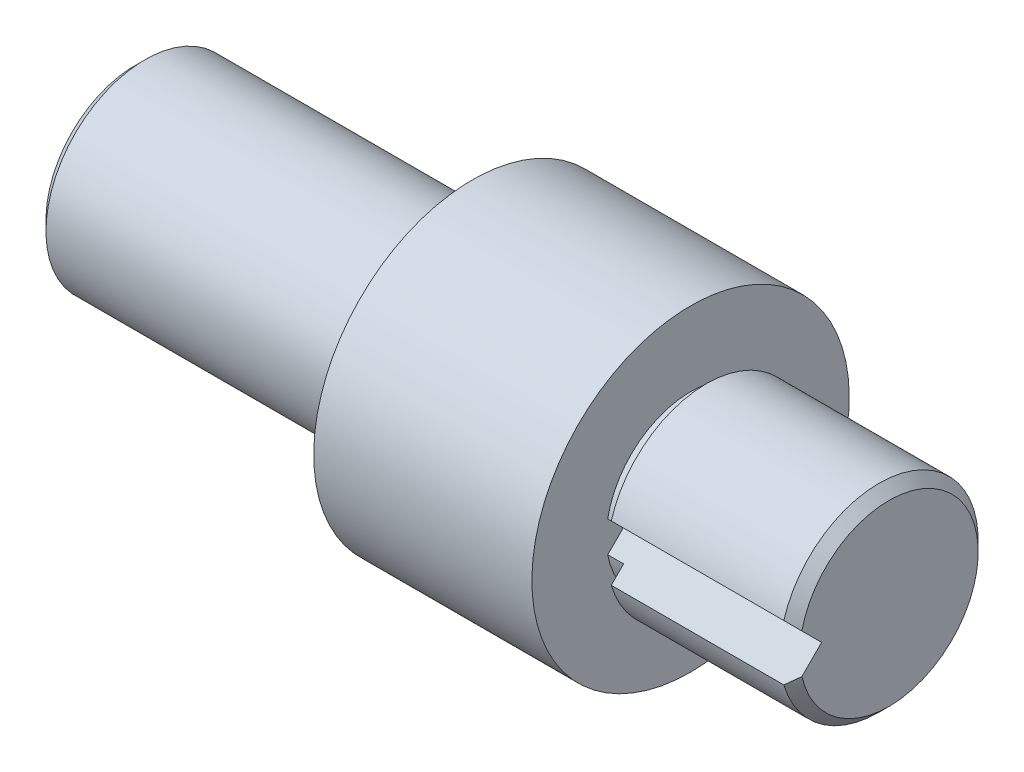
ISO-10303-21;
HEADER;
FILE_DESCRIPTION(('STEP AP214'),'2;1');
FILE_NAME('part.step','',(''),(''),'','','');
FILE_SCHEMA(('AUTOMOTIVE_DESIGN { 1 0 10303 214 1 1 1 1 }'));
ENDSEC;
DATA;
#1=APPLICATION_CONTEXT('core data for automotive mechanical design processes');
#2=APPLICATION_PROTOCOL_DEFINITION('international standard','automotive_design',2000,#1);
#3=PRODUCT_CONTEXT('',#1,'mechanical');
#4=PRODUCT('Part','Part','',(#3));
#5=PRODUCT_RELATED_PRODUCT_CATEGORY('part','',(#4));
#6=PRODUCT_DEFINITION_FORMATION('','',#4);
#7=PRODUCT_DEFINITION_CONTEXT('part definition',#1,'design');
#8=PRODUCT_DEFINITION('design','',#6,#7);
#9=PRODUCT_DEFINITION_SHAPE('','',#8);
#10=(LENGTH_UNIT() NAMED_UNIT(*) SI_UNIT(.MILLI.,.METRE.));
#11=(NAMED_UNIT(*) PLANE_ANGLE_UNIT() SI_UNIT($,.RADIAN.));
#12=(NAMED_UNIT(*) SI_UNIT($,.STERADIAN.) SOLID_ANGLE_UNIT());
#13=UNCERTAINTY_MEASURE_WITH_UNIT(LENGTH_MEASURE(1.E-05),#10,'distance_accuracy_value','');
#14=(GEOMETRIC_REPRESENTATION_CONTEXT(3) GLOBAL_UNCERTAINTY_ASSIGNED_CONTEXT((#13)) GLOBAL_UNIT_ASSIGNED_CONTEXT((#10,
#11,#12)) REPRESENTATION_CONTEXT('',''));
#15=CARTESIAN_POINT('',(0.,0.,0.));
#16=DIRECTION('',(0.,0.,1.));
#17=DIRECTION('',(1.,0.,0.));
#18=AXIS2_PLACEMENT_3D('',#15,#16,#17);
#19=CARTESIAN_POINT('',(98.,0.,0.));
#20=DIRECTION('',(-1.,0.,0.));
#21=DIRECTION('',(0.,1.,0.));
#22=AXIS2_PLACEMENT_3D('',#19,#20,#21);
#23=CYLINDRICAL_SURFACE('',#22,42.5);
#24=DIRECTION('',(-1.,0.,0.));
#25=VECTOR('',#24,1.);
#26=CARTESIAN_POINT('',(98.,-7.83265463432986,41.77199446255));
#27=LINE('',#26,#25);
#28=CARTESIAN_POINT('',(90.,-7.83265463432986,41.77199446255));
#29=VERTEX_POINT('',#28);
#30=CARTESIAN_POINT('',(98.,-7.83265463432986,41.77199446255));
#31=VERTEX_POINT('',#30);
#32=EDGE_CURVE('E10',#29,#31,#27,.F.);
#33=ORIENTED_EDGE('',*,*,#32,.F.);
#34=CARTESIAN_POINT('',(90.,0.,0.));
#35=DIRECTION('',(1.,0.,0.));
#36=DIRECTION('',(0.,-1.,0.));
#37=AXIS2_PLACEMENT_3D('',#34,#35,#36);
#38=CIRCLE('',#37,42.5);
#39=CARTESIAN_POINT('',(90.,7.83265463432986,41.77199446255));
#40=VERTEX_POINT('',#39);
#41=EDGE_CURVE('E24',#29,#40,#38,.T.);
#42=ORIENTED_EDGE('',*,*,#41,.T.);
#43=DIRECTION('',(-1.,0.,0.));
#44=VECTOR('',#43,1.);
#45=CARTESIAN_POINT('',(98.,7.83265463432987,41.77199446255));
#46=LINE('',#45,#44);
#47=CARTESIAN_POINT('',(98.,7.83265463432987,41.77199446255));
#48=VERTEX_POINT('',#47);
#49=EDGE_CURVE('E270',#40,#48,#46,.F.);
#50=ORIENTED_EDGE('',*,*,#49,.T.);
#51=CARTESIAN_POINT('',(98.,0.,0.));
#52=DIRECTION('',(1.,0.,0.));
#53=DIRECTION('',(0.,-1.,0.));
#54=AXIS2_PLACEMENT_3D('',#51,#52,#53);
#55=CIRCLE('',#54,42.5);
#56=EDGE_CURVE('E253',#31,#48,#55,.T.);
#57=ORIENTED_EDGE('',*,*,#56,.F.);
#58=EDGE_LOOP('',(#33,#42,#50,#57));
#59=FACE_BOUND('',#58,.T.);
#60=ADVANCED_FACE('F16',(#59),#23,.T.);
#61=CARTESIAN_POINT('',(98.,0.,0.));
#62=DIRECTION('',(1.,0.,0.));
#63=DIRECTION('',(0.,0.,-1.));
#64=AXIS2_PLACEMENT_3D('',#61,#62,#63);
#65=PLANE('',#64);
#66=DIRECTION('',(0.,-0.707106781186547,0.707106781186548));
#67=VECTOR('',#66,1.);
#68=CARTESIAN_POINT('',(98.,16.9696699141101,16.9696699141101));
#69=LINE('',#68,#67);
#70=CARTESIAN_POINT('',(98.,-14.0469434246499,47.9862832528701));
#71=VERTEX_POINT('',#70);
#72=EDGE_CURVE('E252',#31,#71,#69,.T.);
#73=ORIENTED_EDGE('',*,*,#72,.F.);
#74=ORIENTED_EDGE('',*,*,#56,.T.);
#75=DIRECTION('',(0.,0.707106781186547,0.707106781186548));
#76=VECTOR('',#75,1.);
#77=CARTESIAN_POINT('',(98.,-16.9696699141101,16.9696699141101));
#78=LINE('',#77,#76);
#79=CARTESIAN_POINT('',(98.,14.0469434246499,47.9862832528701));
#80=VERTEX_POINT('',#79);
#81=EDGE_CURVE('E260',#48,#80,#78,.T.);
#82=ORIENTED_EDGE('',*,*,#81,.T.);
#83=CARTESIAN_POINT('',(98.,0.,0.));
#84=DIRECTION('',(1.,0.,0.));
#85=DIRECTION('',(0.,-1.,0.));
#86=AXIS2_PLACEMENT_3D('',#83,#84,#85);
#87=CIRCLE('',#86,50.);
#88=EDGE_CURVE('E256',#71,#80,#87,.T.);
#89=ORIENTED_EDGE('',*,*,#88,.F.);
#90=EDGE_LOOP('',(#73,#74,#82,#89));
#91=FACE_BOUND('',#90,.T.);
#92=ADVANCED_FACE('F239',(#91),#65,.F.);
#93=CARTESIAN_POINT('',(0.,0.,0.));
#94=DIRECTION('',(1.,0.,0.));
#95=DIRECTION('',(0.,-1.,0.));
#96=AXIS2_PLACEMENT_3D('',#93,#94,#95);
#97=CYLINDRICAL_SURFACE('',#96,50.);
#98=DIRECTION('',(1.,0.,0.));
#99=VECTOR('',#98,1.);
#100=CARTESIAN_POINT('',(0.,-14.0469434246499,47.9862832528701));
#101=LINE('',#100,#99);
#102=CARTESIAN_POINT('',(185.,-14.0469434246499,47.9862832528701));
#103=VERTEX_POINT('',#102);
#104=EDGE_CURVE('E280',#71,#103,#101,.T.);
#105=ORIENTED_EDGE('',*,*,#104,.F.);
#106=ORIENTED_EDGE('',*,*,#88,.T.);
#107=DIRECTION('',(1.,0.,0.));
#108=VECTOR('',#107,1.);
#109=CARTESIAN_POINT('',(0.,14.0469434246499,47.9862832528701));
#110=LINE('',#109,#108);
#111=CARTESIAN_POINT('',(185.,14.0469434246499,47.9862832528701));
#112=VERTEX_POINT('',#111);
#113=EDGE_CURVE('E283',#80,#112,#110,.T.);
#114=ORIENTED_EDGE('',*,*,#113,.T.);
#115=CARTESIAN_POINT('',(185.,0.,0.));
#116=DIRECTION('',(-1.,0.,0.));
#117=DIRECTION('',(0.,1.,0.));
#118=AXIS2_PLACEMENT_3D('',#115,#116,#117);
#119=CIRCLE('',#118,50.);
#120=EDGE_CURVE('E286',#112,#103,#119,.T.);
#121=ORIENTED_EDGE('',*,*,#120,.T.);
#122=EDGE_LOOP('',(#105,#106,#114,#121));
#123=FACE_BOUND('',#122,.T.);
#124=ADVANCED_FACE('F243',(#123),#97,.T.);
#125=CARTESIAN_POINT('',(190.,0.,0.));
#126=DIRECTION('',(-1.,0.,0.));
#127=DIRECTION('',(0.,1.,0.));
#128=AXIS2_PLACEMENT_3D('',#125,#126,#127);
#129=CONICAL_SURFACE('',#128,45.,0.785398163397448);
#130=CARTESIAN_POINT('',(190.,0.,0.));
#131=DIRECTION('',(-1.,0.,0.));
#132=DIRECTION('',(0.,1.,0.));
#133=AXIS2_PLACEMENT_3D('',#130,#131,#132);
#134=CIRCLE('',#133,45.);
#135=CARTESIAN_POINT('',(190.,-9.94743065423022,43.8867704824504));
#136=VERTEX_POINT('',#135);
#137=CARTESIAN_POINT('',(190.,9.94743065423022,43.8867704824504));
#138=VERTEX_POINT('',#137);
#139=EDGE_CURVE('E288',#136,#138,#134,.F.);
#140=ORIENTED_EDGE('',*,*,#139,.F.);
#141=CARTESIAN_POINT('',(211.001262638053,16.9703699141101,16.9689699141101));
#142=CARTESIAN_POINT('',(211.00132100937,16.7092190554222,17.230120772798));
#143=CARTESIAN_POINT('',(210.992768828976,16.4480784222024,17.4912614060177));
#144=CARTESIAN_POINT('',(210.958763727207,15.9263895368803,18.0129502913399));
#145=CARTESIAN_POINT('',(210.933313591487,15.6658411942405,18.2734986339797));
#146=CARTESIAN_POINT('',(210.865901353758,15.1463510554629,18.7929887727572));
#147=CARTESIAN_POINT('',(210.823972929956,14.8874070699475,19.0519327582726));
#148=CARTESIAN_POINT('',(210.724209691066,14.3710657776574,19.5682740505628));
#149=CARTESIAN_POINT('',(210.666374333934,14.1136685238943,19.8256713043258));
#150=CARTESIAN_POINT('',(210.472574929819,13.3541240536849,20.5852157745352));
#151=CARTESIAN_POINT('',(210.31496696045,12.8546773790613,21.0846624491588));
#152=CARTESIAN_POINT('',(209.948209221688,11.8652788373485,22.0740609908716));
#153=CARTESIAN_POINT('',(209.739034517823,11.3753316876302,22.5640081405899));
#154=CARTESIAN_POINT('',(209.255088147791,10.3606147767767,23.5787250514435));
#155=CARTESIAN_POINT('',(208.976008588694,9.83687929340208,24.1024605348181));
#156=CARTESIAN_POINT('',(208.374480321438,8.80191410108605,25.1374257271341));
#157=CARTESIAN_POINT('',(208.052014319589,8.29068947546181,25.6486503527584));
#158=CARTESIAN_POINT('',(207.371304771633,7.27942984629425,26.6599099819259));
#159=CARTESIAN_POINT('',(207.013007770877,6.77941296540337,27.1599268628168));
#160=CARTESIAN_POINT('',(206.267713940816,5.79033452198054,28.1490053062396));
#161=CARTESIAN_POINT('',(205.880720478176,5.30127168305995,28.6380681451602));
#162=CARTESIAN_POINT('',(205.074478435229,4.32211545610026,29.6172243721199));
#163=CARTESIAN_POINT('',(204.654705442711,3.83223895333086,30.1071008748893));
#164=CARTESIAN_POINT('',(203.795162733964,2.8613566978441,31.0779831303761));
#165=CARTESIAN_POINT('',(203.355392524081,2.38035116452858,31.5589886636916));
#166=CARTESIAN_POINT('',(202.459782535087,1.42649642523632,32.5128434029839));
#167=CARTESIAN_POINT('',(202.003956849569,0.953640583004033,32.9856992452161));
#168=CARTESIAN_POINT('',(201.078669668715,0.0146718291301209,33.9246679990901));
#169=CARTESIAN_POINT('',(200.609208301858,-0.451441145982424,34.3907809742026));
#170=CARTESIAN_POINT('',(199.534381249478,-1.49915199387172,35.4384918220919));
#171=CARTESIAN_POINT('',(198.925632854948,-2.07901278589279,36.018352614113));
#172=CARTESIAN_POINT('',(197.693441344598,-3.23086836786665,37.1702081960868));
#173=CARTESIAN_POINT('',(197.069997941765,-3.80286300383748,37.7422028320577));
#174=CARTESIAN_POINT('',(195.810847478271,-4.94038394032648,38.8797237685467));
#175=CARTESIAN_POINT('',(195.175136082862,-5.50590783774737,39.4452476659676));
#176=CARTESIAN_POINT('',(193.893740376253,-6.63126034864432,40.5706001768645));
#177=CARTESIAN_POINT('',(193.248056159404,-7.1910890159187,41.1304288441389));
#178=CARTESIAN_POINT('',(191.977243266815,-8.28107124590155,42.2204110741217));
#179=CARTESIAN_POINT('',(191.352478079559,-8.81143697171714,42.7507767999373));
#180=CARTESIAN_POINT('',(190.096444157929,-9.86830622587897,43.8076460540992));
#181=CARTESIAN_POINT('',(189.465175384811,-10.3948097311853,44.3341495594055));
#182=CARTESIAN_POINT('',(188.197554705766,-11.4440443793413,45.3833842075615));
#183=CARTESIAN_POINT('',(187.561207085448,-11.966778113434,45.9061179416542));
#184=CARTESIAN_POINT('',(186.283691184519,-13.0092705949445,46.9486104231647));
#185=CARTESIAN_POINT('',(185.64252302157,-13.5290294144322,47.4683692426524));
#186=CARTESIAN_POINT('',(184.9993,-14.0475076372266,47.9868474654468));
#187=B_SPLINE_CURVE_WITH_KNOTS('',3,(#141,#142,#143,#144,#145,#146,#147,#148,#149,#150,#151,
#152,#153,#154,#155,#156,#157,#158,#159,#160,#161,#162,#163,#164,#165,#166,#167,#168,#169,#170,
#171,#172,#173,#174,#175,#176,#177,#178,#179,#180,#181,#182,#183,#184,#185,#186),.UNSPECIFIED.,
.F.,.F.,(4,2,2,2,2,2,2,2,2,2,2,2,2,2,2,2,2,2,2,2,2,2,4),(0.,1.10784532325466,2.21550806181202,
3.32091864251884,4.42636689574189,6.59500590885997,8.76469560506129,11.1375165568639,
13.5112861247816,15.8886513944538,18.2657381918927,20.6954505791791,23.1252229791155,
25.5529132108967,27.9805805758278,31.0442640740374,34.1080074594968,37.1728539555617,
40.2376714735127,43.1661383392042,46.0946226603617,49.0208533459384,51.9470128382813),.UNSPECIFIED.);
#188=EDGE_CURVE('E215',#136,#103,#187,.T.);
#189=ORIENTED_EDGE('',*,*,#188,.T.);
#190=ORIENTED_EDGE('',*,*,#120,.F.);
#191=CARTESIAN_POINT('',(211.001262638053,-16.9703699141101,16.9689699141101));
#192=CARTESIAN_POINT('',(211.00132100937,-16.7092190554222,17.230120772798));
#193=CARTESIAN_POINT('',(210.992768828976,-16.4480784222024,17.4912614060177));
#194=CARTESIAN_POINT('',(210.958763727207,-15.9263895368803,18.0129502913399));
#195=CARTESIAN_POINT('',(210.933313591487,-15.6658411942405,18.2734986339797));
#196=CARTESIAN_POINT('',(210.865901353758,-15.1463510554629,18.7929887727572));
#197=CARTESIAN_POINT('',(210.823972929956,-14.8874070699475,19.0519327582726));
#198=CARTESIAN_POINT('',(210.724209691066,-14.3710657776574,19.5682740505628));
#199=CARTESIAN_POINT('',(210.666374333934,-14.1136685238943,19.8256713043258));
#200=CARTESIAN_POINT('',(210.472574929819,-13.3541240536849,20.5852157745352));
#201=CARTESIAN_POINT('',(210.31496696045,-12.8546773790613,21.0846624491588));
#202=CARTESIAN_POINT('',(209.948209221688,-11.8652788373485,22.0740609908716));
#203=CARTESIAN_POINT('',(209.739034517823,-11.3753316876302,22.5640081405899));
#204=CARTESIAN_POINT('',(209.255088147791,-10.3606147767767,23.5787250514435));
#205=CARTESIAN_POINT('',(208.976008588694,-9.83687929340208,24.1024605348181));
#206=CARTESIAN_POINT('',(208.374480321438,-8.80191410108605,25.1374257271341));
#207=CARTESIAN_POINT('',(208.052014319589,-8.29068947546181,25.6486503527584));
#208=CARTESIAN_POINT('',(207.371304771633,-7.27942984629425,26.6599099819259));
#209=CARTESIAN_POINT('',(207.013007770877,-6.77941296540337,27.1599268628168));
#210=CARTESIAN_POINT('',(206.267713940816,-5.79033452198054,28.1490053062396));
#211=CARTESIAN_POINT('',(205.880720478176,-5.30127168305995,28.6380681451602));
#212=CARTESIAN_POINT('',(205.074478435229,-4.32211545610026,29.6172243721199));
#213=CARTESIAN_POINT('',(204.654705442711,-3.83223895333086,30.1071008748893));
#214=CARTESIAN_POINT('',(203.795162733964,-2.8613566978441,31.0779831303761));
#215=CARTESIAN_POINT('',(203.355392524081,-2.38035116452858,31.5589886636916));
#216=CARTESIAN_POINT('',(202.459782535087,-1.42649642523632,32.5128434029839));
#217=CARTESIAN_POINT('',(202.003956849569,-0.953640583004033,32.9856992452161));
#218=CARTESIAN_POINT('',(201.078669668715,-0.0146718291301209,33.9246679990901));
#219=CARTESIAN_POINT('',(200.609208301858,0.451441145982424,34.3907809742026));
#220=CARTESIAN_POINT('',(199.534381249478,1.49915199387172,35.4384918220919));
#221=CARTESIAN_POINT('',(198.925632854948,2.07901278589279,36.018352614113));
#222=CARTESIAN_POINT('',(197.693441344598,3.23086836786665,37.1702081960868));
#223=CARTESIAN_POINT('',(197.069997941765,3.80286300383748,37.7422028320577));
#224=CARTESIAN_POINT('',(195.810847478271,4.94038394032648,38.8797237685467));
#225=CARTESIAN_POINT('',(195.175136082862,5.50590783774737,39.4452476659676));
#226=CARTESIAN_POINT('',(193.893740376253,6.63126034864432,40.5706001768645));
#227=CARTESIAN_POINT('',(193.248056159404,7.1910890159187,41.1304288441389));
#228=CARTESIAN_POINT('',(191.977243266815,8.28107124590155,42.2204110741217));
#229=CARTESIAN_POINT('',(191.352478079559,8.81143697171714,42.7507767999373));
#230=CARTESIAN_POINT('',(190.096444157929,9.86830622587897,43.8076460540992));
#231=CARTESIAN_POINT('',(189.465175384811,10.3948097311853,44.3341495594055));
#232=CARTESIAN_POINT('',(188.197554705766,11.4440443793413,45.3833842075615));
#233=CARTESIAN_POINT('',(187.561207085448,11.966778113434,45.9061179416542));
#234=CARTESIAN_POINT('',(186.283691184519,13.0092705949445,46.9486104231647));
#235=CARTESIAN_POINT('',(185.64252302157,13.5290294144322,47.4683692426524));
#236=CARTESIAN_POINT('',(184.9993,14.0475076372266,47.9868474654468));
#237=B_SPLINE_CURVE_WITH_KNOTS('',3,(#191,#192,#193,#194,#195,#196,#197,#198,#199,#200,#201,
#202,#203,#204,#205,#206,#207,#208,#209,#210,#211,#212,#213,#214,#215,#216,#217,#218,#219,#220,
#221,#222,#223,#224,#225,#226,#227,#228,#229,#230,#231,#232,#233,#234,#235,#236),.UNSPECIFIED.,
.F.,.F.,(4,2,2,2,2,2,2,2,2,2,2,2,2,2,2,2,2,2,2,2,2,2,4),(0.,1.10784532325466,2.21550806181202,
3.32091864251884,4.42636689574189,6.59500590885997,8.76469560506129,11.1375165568639,
13.5112861247816,15.8886513944538,18.2657381918927,20.6954505791791,23.1252229791155,
25.5529132108967,27.9805805758278,31.0442640740374,34.1080074594968,37.1728539555617,
40.2376714735127,43.1661383392042,46.0946226603617,49.0208533459384,51.9470128382813),.UNSPECIFIED.);
#238=EDGE_CURVE('E206',#138,#112,#237,.T.);
#239=ORIENTED_EDGE('',*,*,#238,.F.);
#240=EDGE_LOOP('',(#140,#189,#190,#239));
#241=FACE_BOUND('',#240,.T.);
#242=ADVANCED_FACE('F222',(#241),#129,.T.);
#243=CARTESIAN_POINT('',(0.,0.,0.));
#244=DIRECTION('',(1.,0.,0.));
#245=DIRECTION('',(0.,-1.,0.));
#246=AXIS2_PLACEMENT_3D('',#243,#244,#245);
#247=CYLINDRICAL_SURFACE('',#246,50.);
#248=CARTESIAN_POINT('',(-20.,0.,0.));
#249=DIRECTION('',(1.,0.,0.));
#250=DIRECTION('',(0.,-1.,0.));
#251=AXIS2_PLACEMENT_3D('',#248,#249,#250);
#252=CIRCLE('',#251,50.);
#253=CARTESIAN_POINT('',(-20.,-50.,0.));
#254=VERTEX_POINT('',#253);
#255=EDGE_CURVE('E202',#254,#254,#252,.T.);
#256=ORIENTED_EDGE('',*,*,#255,.F.);
#257=EDGE_LOOP('',(#256));
#258=FACE_BOUND('',#257,.T.);
#259=CARTESIAN_POINT('',(-185.,0.,0.));
#260=DIRECTION('',(1.,0.,0.));
#261=DIRECTION('',(0.,-1.,0.));
#262=AXIS2_PLACEMENT_3D('',#259,#260,#261);
#263=CIRCLE('',#262,50.);
#264=CARTESIAN_POINT('',(-185.,-50.,0.));
#265=VERTEX_POINT('',#264);
#266=EDGE_CURVE('E198',#265,#265,#263,.T.);
#267=ORIENTED_EDGE('',*,*,#266,.T.);
#268=EDGE_LOOP('',(#267));
#269=FACE_BOUND('',#268,.T.);
#270=DIRECTION('',(1.,0.,0.));
#271=VECTOR('',#270,1.);
#272=CARTESIAN_POINT('',(0.,-48.9897948556635,-10.));
#273=LINE('',#272,#271);
#274=CARTESIAN_POINT('',(-145.,-48.9897948556635,-10.));
#275=VERTEX_POINT('',#274);
#276=CARTESIAN_POINT('',(-60.,-48.9897948556635,-10.));
#277=VERTEX_POINT('',#276);
#278=EDGE_CURVE('E194',#275,#277,#273,.T.);
#279=ORIENTED_EDGE('',*,*,#278,.F.);
#280=CARTESIAN_POINT('',(-145.,-48.9897948556635,10.));
#281=CARTESIAN_POINT('',(-145.278250654908,-48.9897699291574,10.0000333357109));
#282=CARTESIAN_POINT('',(-145.556492680861,-48.992164609233,9.98838794442636));
#283=CARTESIAN_POINT('',(-146.110929686242,-49.0016122208878,9.94198341928341));
#284=CARTESIAN_POINT('',(-146.387124914627,-49.008664576215,9.90722714472148));
#285=CARTESIAN_POINT('',(-146.935091622416,-49.0272325385723,9.81491465856866));
#286=CARTESIAN_POINT('',(-147.206869187374,-49.0387413456958,9.75739318047743));
#287=CARTESIAN_POINT('',(-147.744506804701,-49.0658769158927,9.62001314196522));
#288=CARTESIAN_POINT('',(-148.010366832909,-49.0815036957769,9.54015449035789));
#289=CARTESIAN_POINT('',(-148.534335659072,-49.1164246464479,9.35870445119324));
#290=CARTESIAN_POINT('',(-148.792443860916,-49.1357190984454,9.2571113971232));
#291=CARTESIAN_POINT('',(-149.299130583575,-49.1774213101814,9.03295210767035));
#292=CARTESIAN_POINT('',(-149.547708825725,-49.1998291608703,8.91038525956354));
#293=CARTESIAN_POINT('',(-150.033676036636,-49.2471257736464,8.64515700263522));
#294=CARTESIAN_POINT('',(-150.271064216013,-49.272014710373,8.50249417899873));
#295=CARTESIAN_POINT('',(-150.733062437915,-49.3235775005206,8.19808055914538));
#296=CARTESIAN_POINT('',(-150.957672398505,-49.3502513653845,8.03632964055267));
#297=CARTESIAN_POINT('',(-151.395329060699,-49.4049846361266,7.69273157073024));
#298=CARTESIAN_POINT('',(-151.608198631959,-49.4330570878751,7.51066083956167));
#299=CARTESIAN_POINT('',(-152.017988917821,-49.4895034689847,7.12925080203784));
#300=CARTESIAN_POINT('',(-152.214902693137,-49.517877523511,6.92990405939758));
#301=CARTESIAN_POINT('',(-152.591377615559,-49.5741299068461,6.51532049891614));
#302=CARTESIAN_POINT('',(-152.770935866606,-49.6020081522899,6.3000810396431));
#303=CARTESIAN_POINT('',(-153.111349281425,-49.6564775379925,5.8552889050474));
#304=CARTESIAN_POINT('',(-153.272212790405,-49.6830692494334,5.62574268701584));
#305=CARTESIAN_POINT('',(-153.575550562996,-49.7344700887598,5.151681691423));
#306=CARTESIAN_POINT('',(-153.717847305987,-49.7592611270118,4.9070513062857));
#307=CARTESIAN_POINT('',(-153.981294447689,-49.8060923791999,4.40640031936312));
#308=CARTESIAN_POINT('',(-154.102444683389,-49.8281325719302,4.15037962979299));
#309=CARTESIAN_POINT('',(-154.322662476411,-49.8688311429154,3.62878653067056));
#310=CARTESIAN_POINT('',(-154.421732832951,-49.8874899497955,3.3632153368644));
#311=CARTESIAN_POINT('',(-154.597032379126,-49.9208936168796,2.82439888898941));
#312=CARTESIAN_POINT('',(-154.673261904089,-49.9356385345431,2.55115374764647));
#313=CARTESIAN_POINT('',(-154.801417905872,-49.9606234229039,2.00262053187489));
#314=CARTESIAN_POINT('',(-154.853650998758,-49.9709201232142,1.7274066603485));
#315=CARTESIAN_POINT('',(-154.93485836934,-49.9869965368054,1.17343752518298));
#316=CARTESIAN_POINT('',(-154.96383282987,-49.9927762855935,0.894682289399612));
#317=CARTESIAN_POINT('',(-154.998286325014,-49.999654433721,0.335683041091922));
#318=CARTESIAN_POINT('',(-155.003766798568,-50.000753119762,0.055439120797931));
#319=CARTESIAN_POINT('',(-154.991191226663,-49.9982386073088,-0.5044976573417));
#320=CARTESIAN_POINT('',(-154.973135364519,-49.9946254455132,-0.784190519462302));
#321=CARTESIAN_POINT('',(-154.914060656264,-49.9828748494924,-1.33700025686813));
#322=CARTESIAN_POINT('',(-154.8733732099,-49.9748027205131,-1.61015401434812));
#323=CARTESIAN_POINT('',(-154.769593778504,-49.954402980861,-2.1520059892224));
#324=CARTESIAN_POINT('',(-154.706502042133,-49.9420754174183,-2.42070425603266));
#325=CARTESIAN_POINT('',(-154.558399137863,-49.9135023812472,-2.95177957601672));
#326=CARTESIAN_POINT('',(-154.473387557183,-49.8972568347381,-3.21415651004949));
#327=CARTESIAN_POINT('',(-154.282084863838,-49.8612903967446,-3.73078800120407));
#328=CARTESIAN_POINT('',(-154.175793546167,-49.8415694717792,-3.98504248004815));
#329=CARTESIAN_POINT('',(-153.941993319284,-49.7990557796206,-4.48524688665998));
#330=CARTESIAN_POINT('',(-153.814358207565,-49.7762449042184,-4.73113627727346));
#331=CARTESIAN_POINT('',(-153.539203162023,-49.7282579698431,-5.21139397424728));
#332=CARTESIAN_POINT('',(-153.391676333132,-49.7030810916636,-5.44575824704121));
#333=CARTESIAN_POINT('',(-153.077818086602,-49.6510544366632,-5.90130100015426));
#334=CARTESIAN_POINT('',(-152.911488704877,-49.6242048411031,-6.12248090410571));
#335=CARTESIAN_POINT('',(-152.561142200263,-49.5695565914247,-6.55023359884725));
#336=CARTESIAN_POINT('',(-152.377124859019,-49.5417579255931,-6.75680620925868));
#337=CARTESIAN_POINT('',(-151.989261356017,-49.4854759153548,-7.15746597535053));
#338=CARTESIAN_POINT('',(-151.78512457887,-49.4569891016899,-7.35127142227593));
#339=CARTESIAN_POINT('',(-151.361265157231,-49.4006234685481,-7.72096918466996));
#340=CARTESIAN_POINT('',(-151.141547425914,-49.372744461004,-7.89686710471781));
#341=CARTESIAN_POINT('',(-150.687852093376,-49.3183630056501,-8.22967334971856));
#342=CARTESIAN_POINT('',(-150.453867975389,-49.2918611973277,-8.38657289717345));
#343=CARTESIAN_POINT('',(-149.973332893309,-49.2410090438121,-8.68016323027539));
#344=CARTESIAN_POINT('',(-149.726782333702,-49.2166586294389,-8.81685466582674));
#345=CARTESIAN_POINT('',(-149.222112019175,-49.1707527082268,-9.06937720273905));
#346=CARTESIAN_POINT('',(-148.963962297199,-49.1492050762103,-9.18514986994259));
#347=CARTESIAN_POINT('',(-148.438553967586,-49.1096227565596,-9.39448287535094));
#348=CARTESIAN_POINT('',(-148.171295685322,-49.0915879435956,-9.48804400604077));
#349=CARTESIAN_POINT('',(-147.629919482344,-49.0595918623669,-9.65212064022865));
#350=CARTESIAN_POINT('',(-147.355810361629,-49.0456256332785,-9.72266422173277));
#351=CARTESIAN_POINT('',(-146.802524948368,-49.0221659831858,-9.84026622036216));
#352=CARTESIAN_POINT('',(-146.523351131185,-49.0126704352163,-9.88733580607651));
#353=CARTESIAN_POINT('',(-146.036481595186,-49.0003245998265,-9.94831108366072));
#354=CARTESIAN_POINT('',(-145.82948346313,-48.9963794230734,-9.96770341545518));
#355=CARTESIAN_POINT('',(-145.41499653944,-48.9911133039178,-9.99354077240532));
#356=CARTESIAN_POINT('',(-145.207509153673,-48.9897879698236,-10.0000074652566));
#357=CARTESIAN_POINT('',(-145.,-48.9897948556635,-10.));
#358=B_SPLINE_CURVE_WITH_KNOTS('',3,(#280,#281,#282,#283,#284,#285,#286,#287,#288,#289,#290,
#291,#292,#293,#294,#295,#296,#297,#298,#299,#300,#301,#302,#303,#304,#305,#306,#307,#308,#309,
#310,#311,#312,#313,#314,#315,#316,#317,#318,#319,#320,#321,#322,#323,#324,#325,#326,#327,#328,
#329,#330,#331,#332,#333,#334,#335,#336,#337,#338,#339,#340,#341,#342,#343,#344,#345,#346,#347,
#348,#349,#350,#351,#352,#353,#354,#355,#356,#357),.UNSPECIFIED.,.F.,.F.,(4,2,2,2,2,2,2,2,2,2,2,
2,2,2,2,2,2,2,2,2,2,2,2,2,2,2,2,2,2,2,2,2,2,2,2,2,2,2,4),(0.,0.834485103579171,1.6688669832153,
2.50198070094781,3.33509781972432,4.16827884171663,5.00148420824011,5.83474826418401,
6.66801766256398,7.51158115302923,8.35550956770959,9.19957856370723,10.0432693137526,
10.8945131311441,11.7457635101916,12.596905908938,13.4480358114242,14.2879652334247,
15.127888052774,15.9677594285132,16.8076242628951,17.635502752376,18.4633720536848,
19.2912569460348,20.1191498144731,20.9521231858445,21.7853860366177,22.6185587490719,
23.451741748192,24.2995033551212,25.1469988142522,25.994884345399,26.8427426021332,
27.6929338228863,28.5430947051213,29.3922146055542,30.2409301206182,30.8643560137552,
31.4867359570873),.UNSPECIFIED.);
#359=CARTESIAN_POINT('',(-145.,-48.9897948556635,10.));
#360=VERTEX_POINT('',#359);
#361=EDGE_CURVE('E186',#360,#275,#358,.T.);
#362=ORIENTED_EDGE('',*,*,#361,.F.);
#363=DIRECTION('',(1.,0.,0.));
#364=VECTOR('',#363,1.);
#365=CARTESIAN_POINT('',(0.,-48.9897948556635,10.));
#366=LINE('',#365,#364);
#367=CARTESIAN_POINT('',(-60.,-48.9897948556635,10.));
#368=VERTEX_POINT('',#367);
#369=EDGE_CURVE('E170',#360,#368,#366,.T.);
#370=ORIENTED_EDGE('',*,*,#369,.T.);
#371=CARTESIAN_POINT('',(-60.,-48.9897948556635,-10.));
#372=CARTESIAN_POINT('',(-59.7217493450925,-48.9897699291574,-10.0000333357109));
#373=CARTESIAN_POINT('',(-59.4435073191387,-48.992164609233,-9.98838794442636));
#374=CARTESIAN_POINT('',(-58.8890703137579,-49.0016122208878,-9.94198341928341));
#375=CARTESIAN_POINT('',(-58.6128750853733,-49.008664576215,-9.90722714472149));
#376=CARTESIAN_POINT('',(-58.0649083775841,-49.0272325385723,-9.81491465856866));
#377=CARTESIAN_POINT('',(-57.7931308126258,-49.0387413456958,-9.75739318047742));
#378=CARTESIAN_POINT('',(-57.2554931952985,-49.0658769158927,-9.62001314196521));
#379=CARTESIAN_POINT('',(-56.9896331670912,-49.0815036957769,-9.54015449035788));
#380=CARTESIAN_POINT('',(-56.4656643409278,-49.1164246464479,-9.35870445119324));
#381=CARTESIAN_POINT('',(-56.2075561390845,-49.1357190984454,-9.2571113971232));
#382=CARTESIAN_POINT('',(-55.700869416425,-49.1774213101814,-9.03295210767034));
#383=CARTESIAN_POINT('',(-55.4522911742749,-49.1998291608703,-8.91038525956353));
#384=CARTESIAN_POINT('',(-54.9663239633635,-49.2471257736464,-8.64515700263517));
#385=CARTESIAN_POINT('',(-54.7289357839871,-49.272014710373,-8.50249417899865));
#386=CARTESIAN_POINT('',(-54.2669375620846,-49.3235775005206,-8.19808055914532));
#387=CARTESIAN_POINT('',(-54.0423276014948,-49.3502513653845,-8.03632964055267));
#388=CARTESIAN_POINT('',(-53.6046709393006,-49.4049846361266,-7.69273157073023));
#389=CARTESIAN_POINT('',(-53.3918013680406,-49.4330570878751,-7.5106608395616));
#390=CARTESIAN_POINT('',(-52.9820110821785,-49.4895034689848,-7.12925080203772));
#391=CARTESIAN_POINT('',(-52.7850973068628,-49.517877523511,-6.92990405939748));
#392=CARTESIAN_POINT('',(-52.4086223844411,-49.5741299068462,-6.51532049891603));
#393=CARTESIAN_POINT('',(-52.2290641333942,-49.6020081522899,-6.30008103964297));
#394=CARTESIAN_POINT('',(-51.8886507185752,-49.6564775379926,-5.85528890504732));
#395=CARTESIAN_POINT('',(-51.7277872095944,-49.6830692494334,-5.62574268701582));
#396=CARTESIAN_POINT('',(-51.4244494370033,-49.7344700887598,-5.15168169142301));
#397=CARTESIAN_POINT('',(-51.2821526940132,-49.7592611270118,-4.90705130628568));
#398=CARTESIAN_POINT('',(-51.0187055523115,-49.8060923791999,-4.40640031936308));
#399=CARTESIAN_POINT('',(-50.897555316611,-49.8281325719302,-4.15037962979298));
#400=CARTESIAN_POINT('',(-50.6773375235886,-49.8688311429154,-3.62878653067058));
#401=CARTESIAN_POINT('',(-50.5782671670493,-49.8874899497955,-3.36321533686444));
#402=CARTESIAN_POINT('',(-50.4029676208739,-49.9208936168796,-2.82439888898944));
#403=CARTESIAN_POINT('',(-50.3267380959109,-49.9356385345431,-2.55115374764648));
#404=CARTESIAN_POINT('',(-50.1985820941282,-49.9606234229039,-2.0026205318749));
#405=CARTESIAN_POINT('',(-50.1463490012422,-49.9709201232142,-1.72740666034852));
#406=CARTESIAN_POINT('',(-50.0651416306597,-49.9869965368053,-1.173437525183));
#407=CARTESIAN_POINT('',(-50.0361671701298,-49.9927762855935,-0.894682289399616));
#408=CARTESIAN_POINT('',(-50.0017136749856,-49.999654433721,-0.335683041091914));
#409=CARTESIAN_POINT('',(-49.9962332014316,-50.000753119762,-0.0554391207979275));
#410=CARTESIAN_POINT('',(-50.0088087733366,-49.9982386073088,0.504497657341704));
#411=CARTESIAN_POINT('',(-50.0268646354811,-49.9946254455132,0.784190519462311));
#412=CARTESIAN_POINT('',(-50.0859393437359,-49.9828748494924,1.33700025686814));
#413=CARTESIAN_POINT('',(-50.1266267900999,-49.9748027205131,1.61015401434812));
#414=CARTESIAN_POINT('',(-50.2304062214956,-49.954402980861,2.15200598922239));
#415=CARTESIAN_POINT('',(-50.2934979578665,-49.9420754174183,2.42070425603265));
#416=CARTESIAN_POINT('',(-50.4416008621372,-49.9135023812472,2.95177957601672));
#417=CARTESIAN_POINT('',(-50.5266124428174,-49.8972568347381,3.21415651004951));
#418=CARTESIAN_POINT('',(-50.7179151361624,-49.8612903967446,3.73078800120408));
#419=CARTESIAN_POINT('',(-50.8242064538328,-49.8415694717792,3.98504248004814));
#420=CARTESIAN_POINT('',(-51.0580066807163,-49.7990557796206,4.48524688665998));
#421=CARTESIAN_POINT('',(-51.1856417924346,-49.7762449042184,4.73113627727348));
#422=CARTESIAN_POINT('',(-51.4607968379773,-49.7282579698431,5.2113939742473));
#423=CARTESIAN_POINT('',(-51.6083236668676,-49.7030810916636,5.44575824704122));
#424=CARTESIAN_POINT('',(-51.9221819133978,-49.6510544366632,5.90130100015424));
#425=CARTESIAN_POINT('',(-52.0885112951226,-49.6242048411031,6.12248090410568));
#426=CARTESIAN_POINT('',(-52.438857799737,-49.5695565914247,6.55023359884723));
#427=CARTESIAN_POINT('',(-52.6228751409808,-49.5417579255931,6.75680620925868));
#428=CARTESIAN_POINT('',(-53.0107386439833,-49.4854759153548,7.15746597535051));
#429=CARTESIAN_POINT('',(-53.2148754211302,-49.4569891016899,7.35127142227588));
#430=CARTESIAN_POINT('',(-53.6387348427689,-49.4006234685481,7.72096918466989));
#431=CARTESIAN_POINT('',(-53.8584525740859,-49.372744461004,7.89686710471776));
#432=CARTESIAN_POINT('',(-54.3121479066242,-49.3183630056501,8.22967334971853));
#433=CARTESIAN_POINT('',(-54.5461320246106,-49.2918611973277,8.38657289717342));
#434=CARTESIAN_POINT('',(-55.0266671066911,-49.2410090438121,8.68016323027538));
#435=CARTESIAN_POINT('',(-55.2732176662981,-49.2166586294389,8.81685466582673));
#436=CARTESIAN_POINT('',(-55.7778879808252,-49.1707527082268,9.06937720273904));
#437=CARTESIAN_POINT('',(-56.036037702801,-49.1492050762103,9.18514986994259));
#438=CARTESIAN_POINT('',(-56.5614460324142,-49.1096227565596,9.39448287535094));
#439=CARTESIAN_POINT('',(-56.8287043146782,-49.0915879435956,9.48804400604076));
#440=CARTESIAN_POINT('',(-57.3700805176564,-49.0595918623669,9.65212064022864));
#441=CARTESIAN_POINT('',(-57.6441896383713,-49.0456256332785,9.72266422173276));
#442=CARTESIAN_POINT('',(-58.1974750516318,-49.0221659831858,9.84026622036216));
#443=CARTESIAN_POINT('',(-58.4766488688151,-49.0126704352163,9.88733580607651));
#444=CARTESIAN_POINT('',(-58.9635184048141,-49.0003245998265,9.94831108366073));
#445=CARTESIAN_POINT('',(-59.1705165368698,-48.9963794230734,9.96770341545518));
#446=CARTESIAN_POINT('',(-59.5850034605595,-48.9911133039178,9.99354077240532));
#447=CARTESIAN_POINT('',(-59.7924908463274,-48.9897879698236,10.0000074652566));
#448=CARTESIAN_POINT('',(-60.,-48.9897948556635,10.));
#449=B_SPLINE_CURVE_WITH_KNOTS('',3,(#371,#372,#373,#374,#375,#376,#377,#378,#379,#380,#381,
#382,#383,#384,#385,#386,#387,#388,#389,#390,#391,#392,#393,#394,#395,#396,#397,#398,#399,#400,
#401,#402,#403,#404,#405,#406,#407,#408,#409,#410,#411,#412,#413,#414,#415,#416,#417,#418,#419,
#420,#421,#422,#423,#424,#425,#426,#427,#428,#429,#430,#431,#432,#433,#434,#435,#436,#437,#438,
#439,#440,#441,#442,#443,#444,#445,#446,#447,#448),.UNSPECIFIED.,.F.,.F.,(4,2,2,2,2,2,2,2,2,2,2,
2,2,2,2,2,2,2,2,2,2,2,2,2,2,2,2,2,2,2,2,2,2,2,2,2,2,2,4),(0.,0.834485103579178,1.66886698321531,
2.50198070094784,3.33509781972431,4.16827884171663,5.00148420824016,5.83474826418416,
6.66801766256413,7.51158115302939,8.35550956770972,9.19957856370738,10.0432693137527,
10.8945131311442,11.7457635101916,12.596905908938,13.4480358114242,14.2879652334247,
15.127888052774,15.9677594285133,16.8076242628951,17.635502752376,18.4633720536848,
19.2912569460349,20.1191498144731,20.9521231858446,21.7853860366177,22.6185587490719,
23.4517417481919,24.2995033551211,25.1469988142521,25.994884345399,26.8427426021332,
27.6929338228863,28.5430947051213,29.3922146055542,30.2409301206182,30.8643560137552,
31.4867359570874),.UNSPECIFIED.);
#450=EDGE_CURVE('E108',#277,#368,#449,.T.);
#451=ORIENTED_EDGE('',*,*,#450,.F.);
#452=EDGE_LOOP('',(#279,#362,#370,#451));
#453=FACE_BOUND('',#452,.T.);
#454=ADVANCED_FACE('F172',(#258,#269,#453),#247,.T.);
#455=CARTESIAN_POINT('',(-190.,25.,0.));
#456=DIRECTION('',(1.,0.,0.));
#457=DIRECTION('',(0.,-1.,0.));
#458=AXIS2_PLACEMENT_3D('',#455,#456,#457);
#459=PLANE('',#458);
#460=CARTESIAN_POINT('',(-190.,0.,0.));
#461=DIRECTION('',(1.,0.,0.));
#462=DIRECTION('',(0.,-1.,0.));
#463=AXIS2_PLACEMENT_3D('',#460,#461,#462);
#464=CIRCLE('',#463,45.);
#465=CARTESIAN_POINT('',(-190.,-45.,0.));
#466=VERTEX_POINT('',#465);
#467=EDGE_CURVE('E158',#466,#466,#464,.F.);
#468=ORIENTED_EDGE('',*,*,#467,.T.);
#469=EDGE_LOOP('',(#468));
#470=FACE_BOUND('',#469,.T.);
#471=ADVANCED_FACE('F179',(#470),#459,.F.);
#472=CARTESIAN_POINT('',(90.,65.,0.));
#473=DIRECTION('',(-1.,0.,0.));
#474=DIRECTION('',(0.,1.,0.));
#475=AXIS2_PLACEMENT_3D('',#472,#473,#474);
#476=PLANE('',#475);
#477=ORIENTED_EDGE('',*,*,#41,.F.);
#478=DIRECTION('',(0.,-0.707106781186547,0.707106781186548));
#479=VECTOR('',#478,1.);
#480=CARTESIAN_POINT('',(90.,-15.9099025766973,49.8492424049175));
#481=LINE('',#480,#479);
#482=CARTESIAN_POINT('',(90.,0.,33.9393398282202));
#483=VERTEX_POINT('',#482);
#484=EDGE_CURVE('E154',#483,#29,#481,.T.);
#485=ORIENTED_EDGE('',*,*,#484,.F.);
#486=DIRECTION('',(0.,0.707106781186547,0.707106781186548));
#487=VECTOR('',#486,1.);
#488=CARTESIAN_POINT('',(90.,15.9099025766973,49.8492424049175));
#489=LINE('',#488,#487);
#490=EDGE_CURVE('E151',#483,#40,#489,.T.);
#491=ORIENTED_EDGE('',*,*,#490,.T.);
#492=EDGE_LOOP('',(#477,#485,#491));
#493=FACE_BOUND('',#492,.T.);
#494=CARTESIAN_POINT('',(90.,0.,0.));
#495=DIRECTION('',(1.,0.,0.));
#496=DIRECTION('',(0.,-1.,0.));
#497=AXIS2_PLACEMENT_3D('',#494,#495,#496);
#498=CIRCLE('',#497,80.);
#499=CARTESIAN_POINT('',(90.,-80.,0.));
#500=VERTEX_POINT('',#499);
#501=EDGE_CURVE('E147',#500,#500,#498,.T.);
#502=ORIENTED_EDGE('',*,*,#501,.T.);
#503=EDGE_LOOP('',(#502));
#504=FACE_BOUND('',#503,.T.);
#505=ADVANCED_FACE('F266',(#493,#504),#476,.F.);
#506=CARTESIAN_POINT('',(0.,0.,0.));
#507=DIRECTION('',(1.,0.,0.));
#508=DIRECTION('',(0.,-1.,0.));
#509=AXIS2_PLACEMENT_3D('',#506,#507,#508);
#510=CYLINDRICAL_SURFACE('',#509,80.);
#511=ORIENTED_EDGE('',*,*,#501,.F.);
#512=EDGE_LOOP('',(#511));
#513=FACE_BOUND('',#512,.T.);
#514=CARTESIAN_POINT('',(-20.,0.,0.));
#515=DIRECTION('',(1.,0.,0.));
#516=DIRECTION('',(0.,-1.,0.));
#517=AXIS2_PLACEMENT_3D('',#514,#515,#516);
#518=CIRCLE('',#517,80.);
#519=CARTESIAN_POINT('',(-20.,-80.,0.));
#520=VERTEX_POINT('',#519);
#521=EDGE_CURVE('E143',#520,#520,#518,.T.);
#522=ORIENTED_EDGE('',*,*,#521,.T.);
#523=EDGE_LOOP('',(#522));
#524=FACE_BOUND('',#523,.T.);
#525=ADVANCED_FACE('F309',(#513,#524),#510,.T.);
#526=CARTESIAN_POINT('',(-20.,65.,0.));
#527=DIRECTION('',(1.,0.,0.));
#528=DIRECTION('',(0.,-1.,0.));
#529=AXIS2_PLACEMENT_3D('',#526,#527,#528);
#530=PLANE('',#529);
#531=ORIENTED_EDGE('',*,*,#521,.F.);
#532=EDGE_LOOP('',(#531));
#533=FACE_BOUND('',#532,.T.);
#534=ORIENTED_EDGE('',*,*,#255,.T.);
#535=EDGE_LOOP('',(#534));
#536=FACE_BOUND('',#535,.T.);
#537=ADVANCED_FACE('F301',(#533,#536),#530,.F.);
#538=CARTESIAN_POINT('',(190.,25.,0.));
#539=DIRECTION('',(-1.,0.,0.));
#540=DIRECTION('',(0.,1.,0.));
#541=AXIS2_PLACEMENT_3D('',#538,#539,#540);
#542=PLANE('',#541);
#543=DIRECTION('',(0.,0.707106781186548,0.707106781186548));
#544=VECTOR('',#543,1.);
#545=CARTESIAN_POINT('',(190.,15.9099025766973,49.8492424049175));
#546=LINE('',#545,#544);
#547=CARTESIAN_POINT('',(190.,0.,33.9393398282202));
#548=VERTEX_POINT('',#547);
#549=EDGE_CURVE('E139',#548,#138,#546,.T.);
#550=ORIENTED_EDGE('',*,*,#549,.F.);
#551=DIRECTION('',(0.,-0.707106781186548,0.707106781186548));
#552=VECTOR('',#551,1.);
#553=CARTESIAN_POINT('',(190.,-15.9099025766973,49.8492424049175));
#554=LINE('',#553,#552);
#555=EDGE_CURVE('E135',#548,#136,#554,.T.);
#556=ORIENTED_EDGE('',*,*,#555,.T.);
#557=ORIENTED_EDGE('',*,*,#139,.T.);
#558=EDGE_LOOP('',(#550,#556,#557));
#559=FACE_BOUND('',#558,.T.);
#560=ADVANCED_FACE('F298',(#559),#542,.F.);
#561=CARTESIAN_POINT('',(-185.,0.,0.));
#562=DIRECTION('',(1.,0.,0.));
#563=DIRECTION('',(0.,-1.,0.));
#564=AXIS2_PLACEMENT_3D('',#561,#562,#563);
#565=CONICAL_SURFACE('',#564,50.,0.785398163397448);
#566=ORIENTED_EDGE('',*,*,#467,.F.);
#567=EDGE_LOOP('',(#566));
#568=FACE_BOUND('',#567,.T.);
#569=ORIENTED_EDGE('',*,*,#266,.F.);
#570=EDGE_LOOP('',(#569));
#571=FACE_BOUND('',#570,.T.);
#572=ADVANCED_FACE('F300',(#568,#571),#565,.T.);
#573=CARTESIAN_POINT('',(-102.5,-72.,-10.));
#574=DIRECTION('',(0.,0.,1.));
#575=DIRECTION('',(0.,-1.,0.));
#576=AXIS2_PLACEMENT_3D('',#573,#574,#575);
#577=PLANE('',#576);
#578=ORIENTED_EDGE('',*,*,#278,.T.);
#579=DIRECTION('',(0.,1.,0.));
#580=VECTOR('',#579,1.);
#581=CARTESIAN_POINT('',(-60.,-72.,-10.));
#582=LINE('',#581,#580);
#583=CARTESIAN_POINT('',(-60.,-25.,-10.));
#584=VERTEX_POINT('',#583);
#585=EDGE_CURVE('E132',#277,#584,#582,.T.);
#586=ORIENTED_EDGE('',*,*,#585,.T.);
#587=DIRECTION('',(1.,0.,0.));
#588=VECTOR('',#587,1.);
#589=CARTESIAN_POINT('',(-102.5,-25.,-10.));
#590=LINE('',#589,#588);
#591=CARTESIAN_POINT('',(-145.,-25.,-10.));
#592=VERTEX_POINT('',#591);
#593=EDGE_CURVE('E112',#592,#584,#590,.T.);
#594=ORIENTED_EDGE('',*,*,#593,.F.);
#595=DIRECTION('',(0.,1.,0.));
#596=VECTOR('',#595,1.);
#597=CARTESIAN_POINT('',(-145.,-72.,-10.));
#598=LINE('',#597,#596);
#599=EDGE_CURVE('E126',#275,#592,#598,.T.);
#600=ORIENTED_EDGE('',*,*,#599,.F.);
#601=EDGE_LOOP('',(#578,#586,#594,#600));
#602=FACE_BOUND('',#601,.T.);
#603=ADVANCED_FACE('F184',(#602),#577,.T.);
#604=CARTESIAN_POINT('',(-145.,-72.,0.));
#605=DIRECTION('',(0.,1.,0.));
#606=DIRECTION('',(1.,0.,0.));
#607=AXIS2_PLACEMENT_3D('',#604,#605,#606);
#608=CYLINDRICAL_SURFACE('',#607,10.);
#609=ORIENTED_EDGE('',*,*,#361,.T.);
#610=ORIENTED_EDGE('',*,*,#599,.T.);
#611=CARTESIAN_POINT('',(-145.,-25.,0.));
#612=DIRECTION('',(0.,-1.,0.));
#613=DIRECTION('',(1.,0.,0.));
#614=AXIS2_PLACEMENT_3D('',#611,#612,#613);
#615=CIRCLE('',#614,10.);
#616=CARTESIAN_POINT('',(-145.,-25.,10.));
#617=VERTEX_POINT('',#616);
#618=EDGE_CURVE('E123',#617,#592,#615,.T.);
#619=ORIENTED_EDGE('',*,*,#618,.F.);
#620=DIRECTION('',(0.,1.,0.));
#621=VECTOR('',#620,1.);
#622=CARTESIAN_POINT('',(-145.,-72.,10.));
#623=LINE('',#622,#621);
#624=EDGE_CURVE('E96',#360,#617,#623,.T.);
#625=ORIENTED_EDGE('',*,*,#624,.F.);
#626=EDGE_LOOP('',(#609,#610,#619,#625));
#627=FACE_BOUND('',#626,.T.);
#628=ADVANCED_FACE('F181',(#627),#608,.F.);
#629=CARTESIAN_POINT('',(-102.5,-72.,10.));
#630=DIRECTION('',(0.,0.,1.));
#631=DIRECTION('',(0.,-1.,0.));
#632=AXIS2_PLACEMENT_3D('',#629,#630,#631);
#633=PLANE('',#632);
#634=ORIENTED_EDGE('',*,*,#624,.T.);
#635=DIRECTION('',(1.,0.,0.));
#636=VECTOR('',#635,1.);
#637=CARTESIAN_POINT('',(-102.5,-25.,10.));
#638=LINE('',#637,#636);
#639=CARTESIAN_POINT('',(-60.,-25.,10.));
#640=VERTEX_POINT('',#639);
#641=EDGE_CURVE('E89',#617,#640,#638,.T.);
#642=ORIENTED_EDGE('',*,*,#641,.T.);
#643=DIRECTION('',(0.,1.,0.));
#644=VECTOR('',#643,1.);
#645=CARTESIAN_POINT('',(-60.,-72.,10.));
#646=LINE('',#645,#644);
#647=EDGE_CURVE('E93',#368,#640,#646,.T.);
#648=ORIENTED_EDGE('',*,*,#647,.F.);
#649=ORIENTED_EDGE('',*,*,#369,.F.);
#650=EDGE_LOOP('',(#634,#642,#648,#649));
#651=FACE_BOUND('',#650,.T.);
#652=ADVANCED_FACE('F91',(#651),#633,.F.);
#653=CARTESIAN_POINT('',(-60.,-72.,0.));
#654=DIRECTION('',(0.,1.,0.));
#655=DIRECTION('',(1.,0.,0.));
#656=AXIS2_PLACEMENT_3D('',#653,#654,#655);
#657=CYLINDRICAL_SURFACE('',#656,10.);
#658=ORIENTED_EDGE('',*,*,#450,.T.);
#659=ORIENTED_EDGE('',*,*,#647,.T.);
#660=CARTESIAN_POINT('',(-60.,-25.,0.));
#661=DIRECTION('',(0.,-1.,0.));
#662=DIRECTION('',(1.,0.,0.));
#663=AXIS2_PLACEMENT_3D('',#660,#661,#662);
#664=CIRCLE('',#663,10.);
#665=EDGE_CURVE('E106',#584,#640,#664,.T.);
#666=ORIENTED_EDGE('',*,*,#665,.F.);
#667=ORIENTED_EDGE('',*,*,#585,.F.);
#668=EDGE_LOOP('',(#658,#659,#666,#667));
#669=FACE_BOUND('',#668,.T.);
#670=ADVANCED_FACE('F104',(#669),#657,.F.);
#671=CARTESIAN_POINT('',(-102.5,-25.,0.));
#672=DIRECTION('',(0.,1.,0.));
#673=DIRECTION('',(1.,0.,0.));
#674=AXIS2_PLACEMENT_3D('',#671,#672,#673);
#675=PLANE('',#674);
#676=ORIENTED_EDGE('',*,*,#593,.T.);
#677=ORIENTED_EDGE('',*,*,#665,.T.);
#678=ORIENTED_EDGE('',*,*,#641,.F.);
#679=ORIENTED_EDGE('',*,*,#618,.T.);
#680=EDGE_LOOP('',(#676,#677,#678,#679));
#681=FACE_BOUND('',#680,.T.);
#682=ADVANCED_FACE('F111',(#681),#675,.F.);
#683=CARTESIAN_POINT('',(89.998,-15.9099025766973,49.8492424049175));
#684=DIRECTION('',(0.,0.707106781186548,0.707106781186547));
#685=DIRECTION('',(0.,-0.707106781186547,0.707106781186548));
#686=AXIS2_PLACEMENT_3D('',#683,#684,#685);
#687=PLANE('',#686);
#688=ORIENTED_EDGE('',*,*,#32,.T.);
#689=ORIENTED_EDGE('',*,*,#72,.T.);
#690=ORIENTED_EDGE('',*,*,#104,.T.);
#691=ORIENTED_EDGE('',*,*,#188,.F.);
#692=ORIENTED_EDGE('',*,*,#555,.F.);
#693=DIRECTION('',(1.,0.,0.));
#694=VECTOR('',#693,1.);
#695=CARTESIAN_POINT('',(89.998,0.,33.9393398282202));
#696=LINE('',#695,#694);
#697=EDGE_CURVE('E114',#483,#548,#696,.T.);
#698=ORIENTED_EDGE('',*,*,#697,.F.);
#699=ORIENTED_EDGE('',*,*,#484,.T.);
#700=EDGE_LOOP('',(#688,#689,#690,#691,#692,#698,#699));
#701=FACE_BOUND('',#700,.T.);
#702=ADVANCED_FACE('F228',(#701),#687,.T.);
#703=CARTESIAN_POINT('',(89.998,15.9099025766973,49.8492424049175));
#704=DIRECTION('',(0.,0.707106781186548,-0.707106781186547));
#705=DIRECTION('',(0.,0.707106781186547,0.707106781186548));
#706=AXIS2_PLACEMENT_3D('',#703,#704,#705);
#707=PLANE('',#706);
#708=ORIENTED_EDGE('',*,*,#490,.F.);
#709=ORIENTED_EDGE('',*,*,#697,.T.);
#710=ORIENTED_EDGE('',*,*,#549,.T.);
#711=ORIENTED_EDGE('',*,*,#238,.T.);
#712=ORIENTED_EDGE('',*,*,#113,.F.);
#713=ORIENTED_EDGE('',*,*,#81,.F.);
#714=ORIENTED_EDGE('',*,*,#49,.F.);
#715=EDGE_LOOP('',(#708,#709,#710,#711,#712,#713,#714));
#716=FACE_BOUND('',#715,.T.);
#717=ADVANCED_FACE('F225',(#716),#707,.F.);
#718=CLOSED_SHELL('',(#60,#92,#124,#242,#454,#471,#505,#525,#537,#560,#572,#603,#628,#652,#670,
#682,#702,#717));
#719=MANIFOLD_SOLID_BREP('B1',#718);
#720=ADVANCED_BREP_SHAPE_REPRESENTATION('',(#18,#719),#14);
#721=SHAPE_DEFINITION_REPRESENTATION(#9,#720);
ENDSEC;
END-ISO-10303-21;
